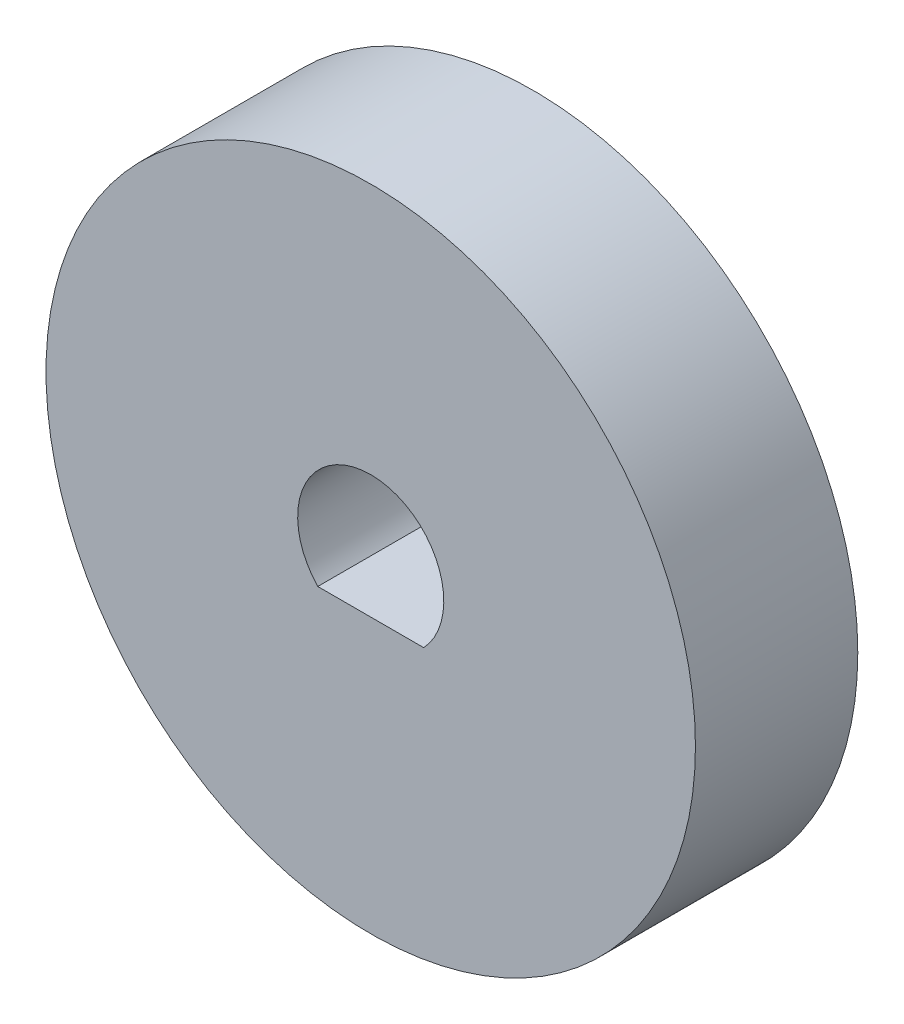
ISO-10303-21;
HEADER;
FILE_DESCRIPTION(('STEP AP214'),'2;1');
FILE_NAME('part.step','',(''),(''),'','','');
FILE_SCHEMA(('AUTOMOTIVE_DESIGN { 1 0 10303 214 1 1 1 1 }'));
ENDSEC;
DATA;
#1=APPLICATION_CONTEXT('core data for automotive mechanical design processes');
#2=APPLICATION_PROTOCOL_DEFINITION('international standard','automotive_design',2000,#1);
#3=PRODUCT_CONTEXT('',#1,'mechanical');
#4=PRODUCT('Part','Part','',(#3));
#5=PRODUCT_RELATED_PRODUCT_CATEGORY('part','',(#4));
#6=PRODUCT_DEFINITION_FORMATION('','',#4);
#7=PRODUCT_DEFINITION_CONTEXT('part definition',#1,'design');
#8=PRODUCT_DEFINITION('design','',#6,#7);
#9=PRODUCT_DEFINITION_SHAPE('','',#8);
#10=(LENGTH_UNIT() NAMED_UNIT(*) SI_UNIT(.MILLI.,.METRE.));
#11=(NAMED_UNIT(*) PLANE_ANGLE_UNIT() SI_UNIT($,.RADIAN.));
#12=(NAMED_UNIT(*) SI_UNIT($,.STERADIAN.) SOLID_ANGLE_UNIT());
#13=UNCERTAINTY_MEASURE_WITH_UNIT(LENGTH_MEASURE(1.E-05),#10,'distance_accuracy_value','');
#14=(GEOMETRIC_REPRESENTATION_CONTEXT(3) GLOBAL_UNCERTAINTY_ASSIGNED_CONTEXT((#13)) GLOBAL_UNIT_ASSIGNED_CONTEXT((#10,
#11,#12)) REPRESENTATION_CONTEXT('',''));
#15=CARTESIAN_POINT('',(0.,0.,0.));
#16=DIRECTION('',(0.,0.,1.));
#17=DIRECTION('',(1.,0.,0.));
#18=AXIS2_PLACEMENT_3D('',#15,#16,#17);
#19=CARTESIAN_POINT('',(0.,0.,5.));
#20=DIRECTION('',(0.,0.,-1.));
#21=DIRECTION('',(-1.,0.,0.));
#22=AXIS2_PLACEMENT_3D('',#19,#20,#21);
#23=CYLINDRICAL_SURFACE('',#22,10.);
#24=CARTESIAN_POINT('',(0.,0.,5.));
#25=DIRECTION('',(0.,0.,1.));
#26=DIRECTION('',(1.,0.,0.));
#27=AXIS2_PLACEMENT_3D('',#24,#25,#26);
#28=CIRCLE('',#27,10.);
#29=CARTESIAN_POINT('',(10.,0.,5.));
#30=VERTEX_POINT('',#29);
#31=EDGE_CURVE('E11',#30,#30,#28,.T.);
#32=ORIENTED_EDGE('',*,*,#31,.F.);
#33=EDGE_LOOP('',(#32));
#34=FACE_BOUND('',#33,.T.);
#35=CARTESIAN_POINT('',(0.,0.,0.));
#36=DIRECTION('',(0.,0.,1.));
#37=DIRECTION('',(1.,0.,0.));
#38=AXIS2_PLACEMENT_3D('',#35,#36,#37);
#39=CIRCLE('',#38,10.);
#40=CARTESIAN_POINT('',(10.,0.,0.));
#41=VERTEX_POINT('',#40);
#42=EDGE_CURVE('E36',#41,#41,#39,.T.);
#43=ORIENTED_EDGE('',*,*,#42,.T.);
#44=EDGE_LOOP('',(#43));
#45=FACE_BOUND('',#44,.T.);
#46=ADVANCED_FACE('F33',(#34,#45),#23,.T.);
#47=CARTESIAN_POINT('',(0.,0.,5.));
#48=DIRECTION('',(0.,0.,1.));
#49=DIRECTION('',(1.,0.,0.));
#50=AXIS2_PLACEMENT_3D('',#47,#48,#49);
#51=PLANE('',#50);
#52=CARTESIAN_POINT('',(0.,0.,5.));
#53=DIRECTION('',(0.,0.,1.));
#54=DIRECTION('',(1.,0.,0.));
#55=AXIS2_PLACEMENT_3D('',#52,#53,#54);
#56=CIRCLE('',#55,2.25);
#57=CARTESIAN_POINT('',(1.63095064303001,-1.55,5.));
#58=VERTEX_POINT('',#57);
#59=CARTESIAN_POINT('',(-1.63095064303001,-1.55,5.));
#60=VERTEX_POINT('',#59);
#61=EDGE_CURVE('E47',#58,#60,#56,.T.);
#62=ORIENTED_EDGE('',*,*,#61,.F.);
#63=DIRECTION('',(1.,0.,0.));
#64=VECTOR('',#63,1.);
#65=CARTESIAN_POINT('',(-1.63095064303001,-1.55,5.));
#66=LINE('',#65,#64);
#67=EDGE_CURVE('E66',#60,#58,#66,.T.);
#68=ORIENTED_EDGE('',*,*,#67,.F.);
#69=EDGE_LOOP('',(#62,#68));
#70=FACE_BOUND('',#69,.T.);
#71=ORIENTED_EDGE('',*,*,#31,.T.);
#72=EDGE_LOOP('',(#71));
#73=FACE_BOUND('',#72,.T.);
#74=ADVANCED_FACE('F70',(#70,#73),#51,.T.);
#75=CARTESIAN_POINT('',(0.,0.,0.));
#76=DIRECTION('',(0.,0.,1.));
#77=DIRECTION('',(1.,0.,0.));
#78=AXIS2_PLACEMENT_3D('',#75,#76,#77);
#79=PLANE('',#78);
#80=DIRECTION('',(1.,0.,0.));
#81=VECTOR('',#80,1.);
#82=CARTESIAN_POINT('',(-1.63095064303001,-1.55,0.));
#83=LINE('',#82,#81);
#84=CARTESIAN_POINT('',(-1.63095064303001,-1.55,0.));
#85=VERTEX_POINT('',#84);
#86=CARTESIAN_POINT('',(1.63095064303001,-1.55,0.));
#87=VERTEX_POINT('',#86);
#88=EDGE_CURVE('E74',#85,#87,#83,.T.);
#89=ORIENTED_EDGE('',*,*,#88,.T.);
#90=CARTESIAN_POINT('',(0.,0.,0.));
#91=DIRECTION('',(0.,0.,1.));
#92=DIRECTION('',(1.,0.,0.));
#93=AXIS2_PLACEMENT_3D('',#90,#91,#92);
#94=CIRCLE('',#93,2.25);
#95=EDGE_CURVE('E52',#87,#85,#94,.T.);
#96=ORIENTED_EDGE('',*,*,#95,.T.);
#97=EDGE_LOOP('',(#89,#96));
#98=FACE_BOUND('',#97,.T.);
#99=ORIENTED_EDGE('',*,*,#42,.F.);
#100=EDGE_LOOP('',(#99));
#101=FACE_BOUND('',#100,.T.);
#102=ADVANCED_FACE('F78',(#98,#101),#79,.F.);
#103=CARTESIAN_POINT('',(0.,0.,0.));
#104=DIRECTION('',(0.,0.,1.));
#105=DIRECTION('',(1.,0.,0.));
#106=AXIS2_PLACEMENT_3D('',#103,#104,#105);
#107=CYLINDRICAL_SURFACE('',#106,2.25);
#108=ORIENTED_EDGE('',*,*,#61,.T.);
#109=DIRECTION('',(0.,0.,1.));
#110=VECTOR('',#109,1.);
#111=CARTESIAN_POINT('',(-1.63095064303001,-1.55,0.));
#112=LINE('',#111,#110);
#113=EDGE_CURVE('E63',#85,#60,#112,.T.);
#114=ORIENTED_EDGE('',*,*,#113,.F.);
#115=ORIENTED_EDGE('',*,*,#95,.F.);
#116=DIRECTION('',(0.,0.,1.));
#117=VECTOR('',#116,1.);
#118=CARTESIAN_POINT('',(1.63095064303001,-1.55,0.));
#119=LINE('',#118,#117);
#120=EDGE_CURVE('E57',#87,#58,#119,.T.);
#121=ORIENTED_EDGE('',*,*,#120,.T.);
#122=EDGE_LOOP('',(#108,#114,#115,#121));
#123=FACE_BOUND('',#122,.T.);
#124=ADVANCED_FACE('F59',(#123),#107,.F.);
#125=CARTESIAN_POINT('',(-1.63095064303001,-1.55,0.));
#126=DIRECTION('',(0.,-1.,0.));
#127=DIRECTION('',(0.,0.,-1.));
#128=AXIS2_PLACEMENT_3D('',#125,#126,#127);
#129=PLANE('',#128);
#130=ORIENTED_EDGE('',*,*,#67,.T.);
#131=ORIENTED_EDGE('',*,*,#120,.F.);
#132=ORIENTED_EDGE('',*,*,#88,.F.);
#133=ORIENTED_EDGE('',*,*,#113,.T.);
#134=EDGE_LOOP('',(#130,#131,#132,#133));
#135=FACE_BOUND('',#134,.T.);
#136=ADVANCED_FACE('F67',(#135),#129,.F.);
#137=CLOSED_SHELL('',(#46,#74,#102,#124,#136));
#138=MANIFOLD_SOLID_BREP('B2',#137);
#139=ADVANCED_BREP_SHAPE_REPRESENTATION('',(#18,#138),#14);
#140=SHAPE_DEFINITION_REPRESENTATION(#9,#139);
ENDSEC;
END-ISO-10303-21;
